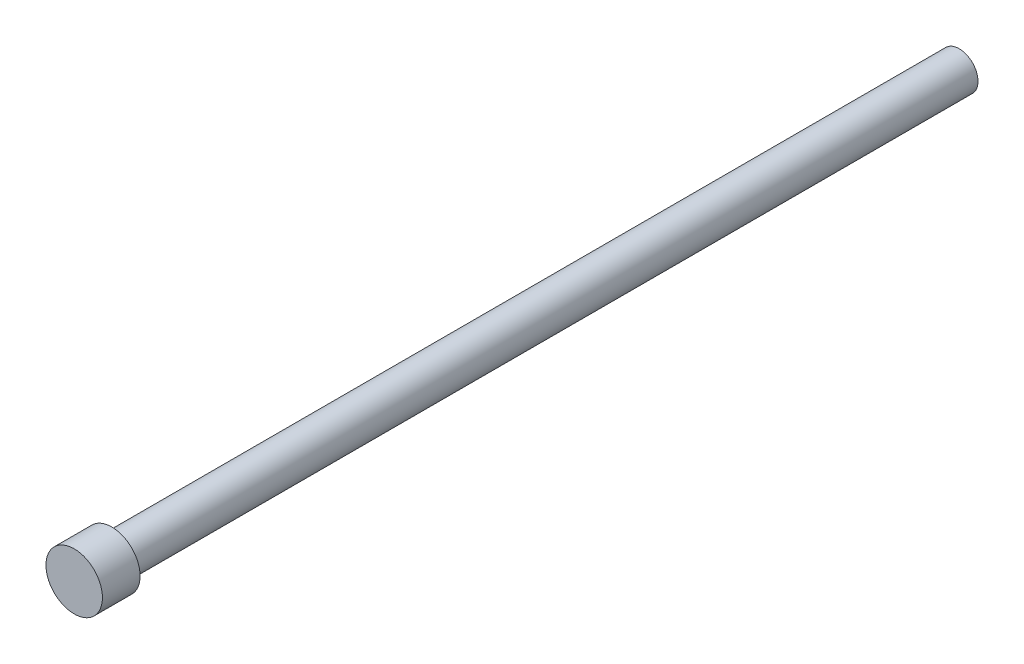
ISO-10303-21;
HEADER;
FILE_DESCRIPTION(('STEP AP214'),'2;1');
FILE_NAME('part.step','',(''),(''),'','','');
FILE_SCHEMA(('AUTOMOTIVE_DESIGN { 1 0 10303 214 1 1 1 1 }'));
ENDSEC;
DATA;
#1=APPLICATION_CONTEXT('core data for automotive mechanical design processes');
#2=APPLICATION_PROTOCOL_DEFINITION('international standard','automotive_design',2000,#1);
#3=PRODUCT_CONTEXT('',#1,'mechanical');
#4=PRODUCT('Part','Part','',(#3));
#5=PRODUCT_RELATED_PRODUCT_CATEGORY('part','',(#4));
#6=PRODUCT_DEFINITION_FORMATION('','',#4);
#7=PRODUCT_DEFINITION_CONTEXT('part definition',#1,'design');
#8=PRODUCT_DEFINITION('design','',#6,#7);
#9=PRODUCT_DEFINITION_SHAPE('','',#8);
#10=(LENGTH_UNIT() NAMED_UNIT(*) SI_UNIT(.MILLI.,.METRE.));
#11=(NAMED_UNIT(*) PLANE_ANGLE_UNIT() SI_UNIT($,.RADIAN.));
#12=(NAMED_UNIT(*) SI_UNIT($,.STERADIAN.) SOLID_ANGLE_UNIT());
#13=UNCERTAINTY_MEASURE_WITH_UNIT(LENGTH_MEASURE(1.E-05),#10,'distance_accuracy_value','');
#14=(GEOMETRIC_REPRESENTATION_CONTEXT(3) GLOBAL_UNCERTAINTY_ASSIGNED_CONTEXT((#13)) GLOBAL_UNIT_ASSIGNED_CONTEXT((#10,
#11,#12)) REPRESENTATION_CONTEXT('',''));
#15=CARTESIAN_POINT('',(0.,0.,0.));
#16=DIRECTION('',(0.,0.,1.));
#17=DIRECTION('',(1.,0.,0.));
#18=AXIS2_PLACEMENT_3D('',#15,#16,#17);
#19=CARTESIAN_POINT('',(0.,0.,45.));
#20=DIRECTION('',(0.,0.,-1.));
#21=DIRECTION('',(-1.,0.,0.));
#22=AXIS2_PLACEMENT_3D('',#19,#20,#21);
#23=CYLINDRICAL_SURFACE('',#22,1.);
#24=CARTESIAN_POINT('',(0.,0.,45.));
#25=DIRECTION('',(0.,0.,1.));
#26=DIRECTION('',(1.,0.,0.));
#27=AXIS2_PLACEMENT_3D('',#24,#25,#26);
#28=CIRCLE('',#27,1.);
#29=CARTESIAN_POINT('',(1.,0.,45.));
#30=VERTEX_POINT('',#29);
#31=EDGE_CURVE('E10',#30,#30,#28,.T.);
#32=ORIENTED_EDGE('',*,*,#31,.F.);
#33=EDGE_LOOP('',(#32));
#34=FACE_BOUND('',#33,.T.);
#35=CARTESIAN_POINT('',(0.,0.,0.));
#36=DIRECTION('',(0.,0.,1.));
#37=DIRECTION('',(1.,0.,0.));
#38=AXIS2_PLACEMENT_3D('',#35,#36,#37);
#39=CIRCLE('',#38,1.);
#40=CARTESIAN_POINT('',(1.,0.,0.));
#41=VERTEX_POINT('',#40);
#42=EDGE_CURVE('E39',#41,#41,#39,.T.);
#43=ORIENTED_EDGE('',*,*,#42,.T.);
#44=EDGE_LOOP('',(#43));
#45=FACE_BOUND('',#44,.T.);
#46=ADVANCED_FACE('F36',(#34,#45),#23,.T.);
#47=CARTESIAN_POINT('',(0.,0.,0.));
#48=DIRECTION('',(0.,0.,1.));
#49=DIRECTION('',(1.,0.,0.));
#50=AXIS2_PLACEMENT_3D('',#47,#48,#49);
#51=PLANE('',#50);
#52=CARTESIAN_POINT('',(0.,0.,0.));
#53=DIRECTION('',(0.,0.,-1.));
#54=DIRECTION('',(-1.,0.,0.));
#55=AXIS2_PLACEMENT_3D('',#52,#53,#54);
#56=CIRCLE('',#55,0.75);
#57=CARTESIAN_POINT('',(-0.75,0.,0.));
#58=VERTEX_POINT('',#57);
#59=EDGE_CURVE('E58',#58,#58,#56,.T.);
#60=ORIENTED_EDGE('',*,*,#59,.F.);
#61=EDGE_LOOP('',(#60));
#62=FACE_BOUND('',#61,.T.);
#63=ORIENTED_EDGE('',*,*,#42,.F.);
#64=EDGE_LOOP('',(#63));
#65=FACE_BOUND('',#64,.T.);
#66=ADVANCED_FACE('F75',(#62,#65),#51,.F.);
#67=CARTESIAN_POINT('',(0.,0.,47.));
#68=DIRECTION('',(0.,0.,-1.));
#69=DIRECTION('',(-1.,0.,0.));
#70=AXIS2_PLACEMENT_3D('',#67,#68,#69);
#71=CYLINDRICAL_SURFACE('',#70,1.5);
#72=CARTESIAN_POINT('',(0.,0.,47.));
#73=DIRECTION('',(0.,0.,1.));
#74=DIRECTION('',(1.,0.,0.));
#75=AXIS2_PLACEMENT_3D('',#72,#73,#74);
#76=CIRCLE('',#75,1.5);
#77=CARTESIAN_POINT('',(1.5,0.,47.));
#78=VERTEX_POINT('',#77);
#79=EDGE_CURVE('E48',#78,#78,#76,.T.);
#80=ORIENTED_EDGE('',*,*,#79,.F.);
#81=EDGE_LOOP('',(#80));
#82=FACE_BOUND('',#81,.T.);
#83=CARTESIAN_POINT('',(0.,0.,45.));
#84=DIRECTION('',(0.,0.,1.));
#85=DIRECTION('',(1.,0.,0.));
#86=AXIS2_PLACEMENT_3D('',#83,#84,#85);
#87=CIRCLE('',#86,1.5);
#88=CARTESIAN_POINT('',(1.5,0.,45.));
#89=VERTEX_POINT('',#88);
#90=EDGE_CURVE('E50',#89,#89,#87,.T.);
#91=ORIENTED_EDGE('',*,*,#90,.T.);
#92=EDGE_LOOP('',(#91));
#93=FACE_BOUND('',#92,.T.);
#94=ADVANCED_FACE('F78',(#82,#93),#71,.T.);
#95=CARTESIAN_POINT('',(0.,0.,47.));
#96=DIRECTION('',(0.,0.,1.));
#97=DIRECTION('',(1.,0.,0.));
#98=AXIS2_PLACEMENT_3D('',#95,#96,#97);
#99=PLANE('',#98);
#100=ORIENTED_EDGE('',*,*,#79,.T.);
#101=EDGE_LOOP('',(#100));
#102=FACE_BOUND('',#101,.T.);
#103=ADVANCED_FACE('F100',(#102),#99,.T.);
#104=CARTESIAN_POINT('',(0.,0.,45.));
#105=DIRECTION('',(0.,0.,1.));
#106=DIRECTION('',(1.,0.,0.));
#107=AXIS2_PLACEMENT_3D('',#104,#105,#106);
#108=PLANE('',#107);
#109=ORIENTED_EDGE('',*,*,#31,.T.);
#110=EDGE_LOOP('',(#109));
#111=FACE_BOUND('',#110,.T.);
#112=ORIENTED_EDGE('',*,*,#90,.F.);
#113=EDGE_LOOP('',(#112));
#114=FACE_BOUND('',#113,.T.);
#115=ADVANCED_FACE('F71',(#111,#114),#108,.F.);
#116=CARTESIAN_POINT('',(0.,0.,20.));
#117=DIRECTION('',(0.,0.,-1.));
#118=DIRECTION('',(-1.,0.,0.));
#119=AXIS2_PLACEMENT_3D('',#116,#117,#118);
#120=CYLINDRICAL_SURFACE('',#119,0.75);
#121=CARTESIAN_POINT('',(0.,0.,20.));
#122=DIRECTION('',(0.,0.,-1.));
#123=DIRECTION('',(-1.,0.,0.));
#124=AXIS2_PLACEMENT_3D('',#121,#122,#123);
#125=CIRCLE('',#124,0.75);
#126=CARTESIAN_POINT('',(-0.75,0.,20.));
#127=VERTEX_POINT('',#126);
#128=EDGE_CURVE('E54',#127,#127,#125,.T.);
#129=ORIENTED_EDGE('',*,*,#128,.F.);
#130=EDGE_LOOP('',(#129));
#131=FACE_BOUND('',#130,.T.);
#132=ORIENTED_EDGE('',*,*,#59,.T.);
#133=EDGE_LOOP('',(#132));
#134=FACE_BOUND('',#133,.T.);
#135=ADVANCED_FACE('F68',(#131,#134),#120,.F.);
#136=CARTESIAN_POINT('',(0.,0.,20.));
#137=DIRECTION('',(0.,0.,-1.));
#138=DIRECTION('',(-1.,0.,0.));
#139=AXIS2_PLACEMENT_3D('',#136,#137,#138);
#140=PLANE('',#139);
#141=ORIENTED_EDGE('',*,*,#128,.T.);
#142=EDGE_LOOP('',(#141));
#143=FACE_BOUND('',#142,.T.);
#144=ADVANCED_FACE('F66',(#143),#140,.T.);
#145=CLOSED_SHELL('',(#46,#66,#94,#103,#115,#135,#144));
#146=MANIFOLD_SOLID_BREP('B2',#145);
#147=ADVANCED_BREP_SHAPE_REPRESENTATION('',(#18,#146),#14);
#148=SHAPE_DEFINITION_REPRESENTATION(#9,#147);
ENDSEC;
END-ISO-10303-21;
